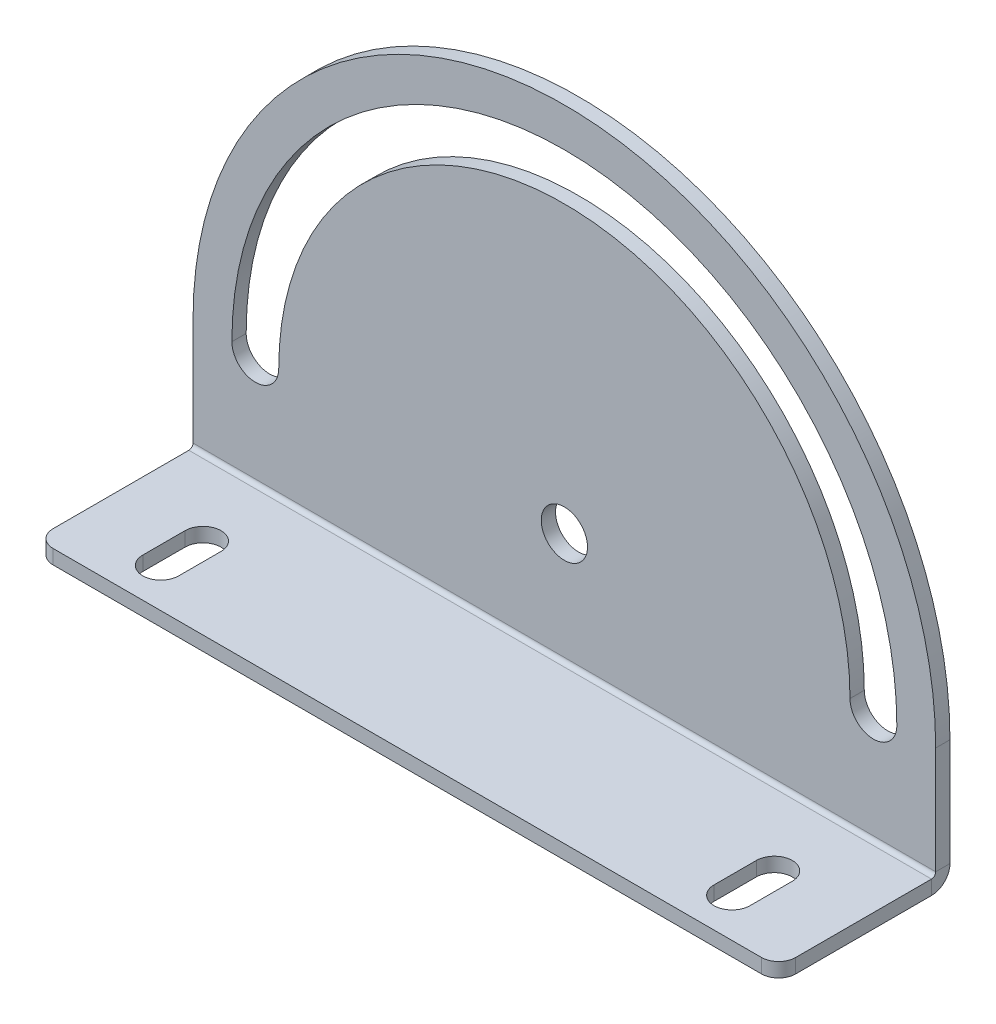
ISO-10303-21;
HEADER;
FILE_DESCRIPTION(('STEP AP214'),'2;1');
FILE_NAME('part.step','',(''),(''),'','','');
FILE_SCHEMA(('AUTOMOTIVE_DESIGN { 1 0 10303 214 1 1 1 1 }'));
ENDSEC;
DATA;
#1=APPLICATION_CONTEXT('core data for automotive mechanical design processes');
#2=APPLICATION_PROTOCOL_DEFINITION('international standard','automotive_design',2000,#1);
#3=PRODUCT_CONTEXT('',#1,'mechanical');
#4=PRODUCT('Part','Part','',(#3));
#5=PRODUCT_RELATED_PRODUCT_CATEGORY('part','',(#4));
#6=PRODUCT_DEFINITION_FORMATION('','',#4);
#7=PRODUCT_DEFINITION_CONTEXT('part definition',#1,'design');
#8=PRODUCT_DEFINITION('design','',#6,#7);
#9=PRODUCT_DEFINITION_SHAPE('','',#8);
#10=(LENGTH_UNIT() NAMED_UNIT(*) SI_UNIT(.MILLI.,.METRE.));
#11=(NAMED_UNIT(*) PLANE_ANGLE_UNIT() SI_UNIT($,.RADIAN.));
#12=(NAMED_UNIT(*) SI_UNIT($,.STERADIAN.) SOLID_ANGLE_UNIT());
#13=UNCERTAINTY_MEASURE_WITH_UNIT(LENGTH_MEASURE(1.E-05),#10,'distance_accuracy_value','');
#14=(GEOMETRIC_REPRESENTATION_CONTEXT(3) GLOBAL_UNCERTAINTY_ASSIGNED_CONTEXT((#13)) GLOBAL_UNIT_ASSIGNED_CONTEXT((#10,
#11,#12)) REPRESENTATION_CONTEXT('',''));
#15=CARTESIAN_POINT('',(0.,0.,0.));
#16=DIRECTION('',(0.,0.,1.));
#17=DIRECTION('',(1.,0.,0.));
#18=AXIS2_PLACEMENT_3D('',#15,#16,#17);
#19=CARTESIAN_POINT('',(130.,0.,-2.5));
#20=DIRECTION('',(1.,0.,0.));
#21=DIRECTION('',(0.,1.,0.));
#22=AXIS2_PLACEMENT_3D('',#19,#20,#21);
#23=PLANE('',#22);
#24=DIRECTION('',(0.,1.,0.));
#25=VECTOR('',#24,1.);
#26=CARTESIAN_POINT('',(130.,0.,0.));
#27=LINE('',#26,#25);
#28=CARTESIAN_POINT('',(130.,3.2366,0.));
#29=VERTEX_POINT('',#28);
#30=CARTESIAN_POINT('',(130.,22.,0.));
#31=VERTEX_POINT('',#30);
#32=EDGE_CURVE('E378',#29,#31,#27,.T.);
#33=ORIENTED_EDGE('',*,*,#32,.F.);
#34=DIRECTION('',(0.,0.,-1.));
#35=VECTOR('',#34,1.);
#36=CARTESIAN_POINT('',(130.,3.2366,0.));
#37=LINE('',#36,#35);
#38=CARTESIAN_POINT('',(130.,3.2366,-2.5));
#39=VERTEX_POINT('',#38);
#40=EDGE_CURVE('E312',#29,#39,#37,.T.);
#41=ORIENTED_EDGE('',*,*,#40,.T.);
#42=DIRECTION('',(0.,1.,0.));
#43=VECTOR('',#42,1.);
#44=CARTESIAN_POINT('',(130.,0.,-2.5));
#45=LINE('',#44,#43);
#46=CARTESIAN_POINT('',(130.,22.,-2.5));
#47=VERTEX_POINT('',#46);
#48=EDGE_CURVE('E369',#39,#47,#45,.T.);
#49=ORIENTED_EDGE('',*,*,#48,.T.);
#50=DIRECTION('',(0.,0.,1.));
#51=VECTOR('',#50,1.);
#52=CARTESIAN_POINT('',(130.,22.,-2.5));
#53=LINE('',#52,#51);
#54=EDGE_CURVE('E375',#47,#31,#53,.T.);
#55=ORIENTED_EDGE('',*,*,#54,.T.);
#56=EDGE_LOOP('',(#33,#41,#49,#55));
#57=FACE_BOUND('',#56,.T.);
#58=ADVANCED_FACE('F58',(#57),#23,.T.);
#59=CARTESIAN_POINT('',(65.,22.,-2.5));
#60=DIRECTION('',(0.,0.,-1.));
#61=DIRECTION('',(-1.,0.,0.));
#62=AXIS2_PLACEMENT_3D('',#59,#60,#61);
#63=PLANE('',#62);
#64=CARTESIAN_POINT('',(119.1,22.,-2.5));
#65=DIRECTION('',(0.,0.,1.));
#66=DIRECTION('',(1.,0.,0.));
#67=AXIS2_PLACEMENT_3D('',#64,#65,#66);
#68=CIRCLE('',#67,4.1);
#69=CARTESIAN_POINT('',(115.,22.,-2.5));
#70=VERTEX_POINT('',#69);
#71=CARTESIAN_POINT('',(123.2,22.,-2.5));
#72=VERTEX_POINT('',#71);
#73=EDGE_CURVE('E328',#70,#72,#68,.T.);
#74=ORIENTED_EDGE('',*,*,#73,.T.);
#75=CARTESIAN_POINT('',(65.,22.,-2.5));
#76=DIRECTION('',(0.,0.,1.));
#77=DIRECTION('',(1.,0.,0.));
#78=AXIS2_PLACEMENT_3D('',#75,#76,#77);
#79=CIRCLE('',#78,58.2);
#80=CARTESIAN_POINT('',(6.8,22.,-2.5));
#81=VERTEX_POINT('',#80);
#82=EDGE_CURVE('E331',#72,#81,#79,.T.);
#83=ORIENTED_EDGE('',*,*,#82,.T.);
#84=CARTESIAN_POINT('',(10.9,22.,-2.5));
#85=DIRECTION('',(0.,0.,1.));
#86=DIRECTION('',(1.,0.,0.));
#87=AXIS2_PLACEMENT_3D('',#84,#85,#86);
#88=CIRCLE('',#87,4.1);
#89=CARTESIAN_POINT('',(15.,22.,-2.5));
#90=VERTEX_POINT('',#89);
#91=EDGE_CURVE('E335',#81,#90,#88,.T.);
#92=ORIENTED_EDGE('',*,*,#91,.T.);
#93=CARTESIAN_POINT('',(65.,22.,-2.5));
#94=DIRECTION('',(0.,0.,-1.));
#95=DIRECTION('',(1.,0.,0.));
#96=AXIS2_PLACEMENT_3D('',#93,#94,#95);
#97=CIRCLE('',#96,50.);
#98=EDGE_CURVE('E338',#90,#70,#97,.T.);
#99=ORIENTED_EDGE('',*,*,#98,.T.);
#100=EDGE_LOOP('',(#74,#83,#92,#99));
#101=FACE_BOUND('',#100,.T.);
#102=CARTESIAN_POINT('',(65.,22.,-2.5));
#103=DIRECTION('',(0.,0.,1.));
#104=DIRECTION('',(1.,0.,0.));
#105=AXIS2_PLACEMENT_3D('',#102,#103,#104);
#106=CIRCLE('',#105,4.05);
#107=CARTESIAN_POINT('',(69.05,22.,-2.5));
#108=VERTEX_POINT('',#107);
#109=EDGE_CURVE('E360',#108,#108,#106,.T.);
#110=ORIENTED_EDGE('',*,*,#109,.T.);
#111=EDGE_LOOP('',(#110));
#112=FACE_BOUND('',#111,.T.);
#113=ORIENTED_EDGE('',*,*,#48,.F.);
#114=DIRECTION('',(1.,0.,0.));
#115=VECTOR('',#114,1.);
#116=CARTESIAN_POINT('',(130.,3.2366,-2.5));
#117=LINE('',#116,#115);
#118=CARTESIAN_POINT('',(0.,3.23660000000001,-2.5));
#119=VERTEX_POINT('',#118);
#120=EDGE_CURVE('E305',#39,#119,#117,.F.);
#121=ORIENTED_EDGE('',*,*,#120,.T.);
#122=DIRECTION('',(0.,-1.,0.));
#123=VECTOR('',#122,1.);
#124=CARTESIAN_POINT('',(0.,0.,-2.5));
#125=LINE('',#124,#123);
#126=CARTESIAN_POINT('',(0.,22.,-2.5));
#127=VERTEX_POINT('',#126);
#128=EDGE_CURVE('E366',#127,#119,#125,.T.);
#129=ORIENTED_EDGE('',*,*,#128,.F.);
#130=CARTESIAN_POINT('',(65.,22.,-2.5));
#131=DIRECTION('',(0.,0.,1.));
#132=DIRECTION('',(-1.,0.,0.));
#133=AXIS2_PLACEMENT_3D('',#130,#131,#132);
#134=CIRCLE('',#133,65.);
#135=EDGE_CURVE('E372',#47,#127,#134,.T.);
#136=ORIENTED_EDGE('',*,*,#135,.F.);
#137=EDGE_LOOP('',(#113,#121,#129,#136));
#138=FACE_BOUND('',#137,.T.);
#139=ADVANCED_FACE('F448',(#101,#112,#138),#63,.T.);
#140=CARTESIAN_POINT('',(65.,22.,0.));
#141=DIRECTION('',(0.,0.,-1.));
#142=DIRECTION('',(-1.,0.,0.));
#143=AXIS2_PLACEMENT_3D('',#140,#141,#142);
#144=PLANE('',#143);
#145=CARTESIAN_POINT('',(65.,22.,0.));
#146=DIRECTION('',(0.,0.,1.));
#147=DIRECTION('',(1.,0.,0.));
#148=AXIS2_PLACEMENT_3D('',#145,#146,#147);
#149=CIRCLE('',#148,4.05);
#150=CARTESIAN_POINT('',(69.05,22.,0.));
#151=VERTEX_POINT('',#150);
#152=EDGE_CURVE('E353',#151,#151,#149,.T.);
#153=ORIENTED_EDGE('',*,*,#152,.F.);
#154=EDGE_LOOP('',(#153));
#155=FACE_BOUND('',#154,.T.);
#156=CARTESIAN_POINT('',(65.,22.,0.));
#157=DIRECTION('',(0.,0.,1.));
#158=DIRECTION('',(1.,0.,0.));
#159=AXIS2_PLACEMENT_3D('',#156,#157,#158);
#160=CIRCLE('',#159,58.2);
#161=CARTESIAN_POINT('',(123.2,22.,0.));
#162=VERTEX_POINT('',#161);
#163=CARTESIAN_POINT('',(6.8,22.,0.));
#164=VERTEX_POINT('',#163);
#165=EDGE_CURVE('E343',#162,#164,#160,.T.);
#166=ORIENTED_EDGE('',*,*,#165,.F.);
#167=CARTESIAN_POINT('',(119.1,22.,0.));
#168=DIRECTION('',(0.,0.,1.));
#169=DIRECTION('',(1.,0.,0.));
#170=AXIS2_PLACEMENT_3D('',#167,#168,#169);
#171=CIRCLE('',#170,4.1);
#172=CARTESIAN_POINT('',(115.,22.,0.));
#173=VERTEX_POINT('',#172);
#174=EDGE_CURVE('E325',#173,#162,#171,.T.);
#175=ORIENTED_EDGE('',*,*,#174,.F.);
#176=CARTESIAN_POINT('',(65.,22.,0.));
#177=DIRECTION('',(0.,0.,-1.));
#178=DIRECTION('',(1.,0.,0.));
#179=AXIS2_PLACEMENT_3D('',#176,#177,#178);
#180=CIRCLE('',#179,50.);
#181=CARTESIAN_POINT('',(15.,22.,0.));
#182=VERTEX_POINT('',#181);
#183=EDGE_CURVE('E332',#182,#173,#180,.T.);
#184=ORIENTED_EDGE('',*,*,#183,.F.);
#185=CARTESIAN_POINT('',(10.9,22.,0.));
#186=DIRECTION('',(0.,0.,1.));
#187=DIRECTION('',(1.,0.,0.));
#188=AXIS2_PLACEMENT_3D('',#185,#186,#187);
#189=CIRCLE('',#188,4.1);
#190=EDGE_CURVE('E346',#164,#182,#189,.T.);
#191=ORIENTED_EDGE('',*,*,#190,.F.);
#192=EDGE_LOOP('',(#166,#175,#184,#191));
#193=FACE_BOUND('',#192,.T.);
#194=DIRECTION('',(1.,0.,0.));
#195=VECTOR('',#194,1.);
#196=CARTESIAN_POINT('',(130.,3.2366,0.));
#197=LINE('',#196,#195);
#198=CARTESIAN_POINT('',(0.,3.2366,0.));
#199=VERTEX_POINT('',#198);
#200=EDGE_CURVE('E318',#29,#199,#197,.F.);
#201=ORIENTED_EDGE('',*,*,#200,.F.);
#202=ORIENTED_EDGE('',*,*,#32,.T.);
#203=CARTESIAN_POINT('',(65.,22.,0.));
#204=DIRECTION('',(0.,0.,1.));
#205=DIRECTION('',(-1.,0.,0.));
#206=AXIS2_PLACEMENT_3D('',#203,#204,#205);
#207=CIRCLE('',#206,65.);
#208=CARTESIAN_POINT('',(0.,22.,0.));
#209=VERTEX_POINT('',#208);
#210=EDGE_CURVE('E370',#31,#209,#207,.T.);
#211=ORIENTED_EDGE('',*,*,#210,.T.);
#212=DIRECTION('',(0.,-1.,0.));
#213=VECTOR('',#212,1.);
#214=CARTESIAN_POINT('',(0.,0.,0.));
#215=LINE('',#214,#213);
#216=EDGE_CURVE('E363',#209,#199,#215,.T.);
#217=ORIENTED_EDGE('',*,*,#216,.T.);
#218=EDGE_LOOP('',(#201,#202,#211,#217));
#219=FACE_BOUND('',#218,.T.);
#220=ADVANCED_FACE('F439',(#155,#193,#219),#144,.F.);
#221=CARTESIAN_POINT('',(0.,0.,-2.5));
#222=DIRECTION('',(-1.,0.,0.));
#223=DIRECTION('',(0.,0.,1.));
#224=AXIS2_PLACEMENT_3D('',#221,#222,#223);
#225=PLANE('',#224);
#226=DIRECTION('',(0.,0.,-1.));
#227=VECTOR('',#226,1.);
#228=CARTESIAN_POINT('',(0.,3.2366,0.));
#229=LINE('',#228,#227);
#230=EDGE_CURVE('E322',#199,#119,#229,.T.);
#231=ORIENTED_EDGE('',*,*,#230,.F.);
#232=ORIENTED_EDGE('',*,*,#216,.F.);
#233=DIRECTION('',(0.,0.,1.));
#234=VECTOR('',#233,1.);
#235=CARTESIAN_POINT('',(0.,22.,-2.5));
#236=LINE('',#235,#234);
#237=EDGE_CURVE('E382',#127,#209,#236,.T.);
#238=ORIENTED_EDGE('',*,*,#237,.F.);
#239=ORIENTED_EDGE('',*,*,#128,.T.);
#240=EDGE_LOOP('',(#231,#232,#238,#239));
#241=FACE_BOUND('',#240,.T.);
#242=ADVANCED_FACE('F443',(#241),#225,.T.);
#243=CARTESIAN_POINT('',(65.,22.,-2.5));
#244=DIRECTION('',(0.,0.,1.));
#245=DIRECTION('',(1.,0.,0.));
#246=AXIS2_PLACEMENT_3D('',#243,#244,#245);
#247=CYLINDRICAL_SURFACE('',#246,65.);
#248=ORIENTED_EDGE('',*,*,#210,.F.);
#249=ORIENTED_EDGE('',*,*,#54,.F.);
#250=ORIENTED_EDGE('',*,*,#135,.T.);
#251=ORIENTED_EDGE('',*,*,#237,.T.);
#252=EDGE_LOOP('',(#248,#249,#250,#251));
#253=FACE_BOUND('',#252,.T.);
#254=ADVANCED_FACE('F451',(#253),#247,.T.);
#255=CARTESIAN_POINT('',(65.,22.,-2.5));
#256=DIRECTION('',(0.,0.,1.));
#257=DIRECTION('',(1.,0.,0.));
#258=AXIS2_PLACEMENT_3D('',#255,#256,#257);
#259=CYLINDRICAL_SURFACE('',#258,4.05);
#260=ORIENTED_EDGE('',*,*,#109,.F.);
#261=EDGE_LOOP('',(#260));
#262=FACE_BOUND('',#261,.T.);
#263=ORIENTED_EDGE('',*,*,#152,.T.);
#264=EDGE_LOOP('',(#263));
#265=FACE_BOUND('',#264,.T.);
#266=ADVANCED_FACE('F505',(#262,#265),#259,.F.);
#267=CARTESIAN_POINT('',(119.1,22.,-2.5));
#268=DIRECTION('',(0.,0.,1.));
#269=DIRECTION('',(1.,0.,0.));
#270=AXIS2_PLACEMENT_3D('',#267,#268,#269);
#271=CYLINDRICAL_SURFACE('',#270,4.1);
#272=ORIENTED_EDGE('',*,*,#174,.T.);
#273=DIRECTION('',(0.,0.,1.));
#274=VECTOR('',#273,1.);
#275=CARTESIAN_POINT('',(123.2,22.,-2.5));
#276=LINE('',#275,#274);
#277=EDGE_CURVE('E341',#72,#162,#276,.T.);
#278=ORIENTED_EDGE('',*,*,#277,.F.);
#279=ORIENTED_EDGE('',*,*,#73,.F.);
#280=DIRECTION('',(0.,0.,1.));
#281=VECTOR('',#280,1.);
#282=CARTESIAN_POINT('',(115.,22.,-2.5));
#283=LINE('',#282,#281);
#284=EDGE_CURVE('E351',#70,#173,#283,.T.);
#285=ORIENTED_EDGE('',*,*,#284,.T.);
#286=EDGE_LOOP('',(#272,#278,#279,#285));
#287=FACE_BOUND('',#286,.T.);
#288=ADVANCED_FACE('F495',(#287),#271,.F.);
#289=CARTESIAN_POINT('',(65.,22.,-2.5));
#290=DIRECTION('',(0.,0.,1.));
#291=DIRECTION('',(1.,0.,0.));
#292=AXIS2_PLACEMENT_3D('',#289,#290,#291);
#293=CYLINDRICAL_SURFACE('',#292,50.);
#294=ORIENTED_EDGE('',*,*,#183,.T.);
#295=ORIENTED_EDGE('',*,*,#284,.F.);
#296=ORIENTED_EDGE('',*,*,#98,.F.);
#297=DIRECTION('',(0.,0.,1.));
#298=VECTOR('',#297,1.);
#299=CARTESIAN_POINT('',(15.,22.,-2.5));
#300=LINE('',#299,#298);
#301=EDGE_CURVE('E354',#90,#182,#300,.T.);
#302=ORIENTED_EDGE('',*,*,#301,.T.);
#303=EDGE_LOOP('',(#294,#295,#296,#302));
#304=FACE_BOUND('',#303,.T.);
#305=ADVANCED_FACE('F491',(#304),#293,.T.);
#306=CARTESIAN_POINT('',(10.9,22.,-2.5));
#307=DIRECTION('',(0.,0.,1.));
#308=DIRECTION('',(1.,0.,0.));
#309=AXIS2_PLACEMENT_3D('',#306,#307,#308);
#310=CYLINDRICAL_SURFACE('',#309,4.1);
#311=ORIENTED_EDGE('',*,*,#190,.T.);
#312=ORIENTED_EDGE('',*,*,#301,.F.);
#313=ORIENTED_EDGE('',*,*,#91,.F.);
#314=DIRECTION('',(0.,0.,1.));
#315=VECTOR('',#314,1.);
#316=CARTESIAN_POINT('',(6.8,22.,-2.5));
#317=LINE('',#316,#315);
#318=EDGE_CURVE('E356',#81,#164,#317,.T.);
#319=ORIENTED_EDGE('',*,*,#318,.T.);
#320=EDGE_LOOP('',(#311,#312,#313,#319));
#321=FACE_BOUND('',#320,.T.);
#322=ADVANCED_FACE('F494',(#321),#310,.F.);
#323=CARTESIAN_POINT('',(65.,22.,-2.5));
#324=DIRECTION('',(0.,0.,1.));
#325=DIRECTION('',(1.,0.,0.));
#326=AXIS2_PLACEMENT_3D('',#323,#324,#325);
#327=CYLINDRICAL_SURFACE('',#326,58.2);
#328=ORIENTED_EDGE('',*,*,#165,.T.);
#329=ORIENTED_EDGE('',*,*,#318,.F.);
#330=ORIENTED_EDGE('',*,*,#82,.F.);
#331=ORIENTED_EDGE('',*,*,#277,.T.);
#332=EDGE_LOOP('',(#328,#329,#330,#331));
#333=FACE_BOUND('',#332,.T.);
#334=ADVANCED_FACE('F488',(#333),#327,.F.);
#335=CARTESIAN_POINT('',(0.,3.2366,0.7366));
#336=DIRECTION('',(-1.,0.,0.));
#337=DIRECTION('',(0.,0.,1.));
#338=AXIS2_PLACEMENT_3D('',#335,#336,#337);
#339=PLANE('',#338);
#340=DIRECTION('',(0.,1.,0.));
#341=VECTOR('',#340,1.);
#342=CARTESIAN_POINT('',(0.,0.,0.736599999999989));
#343=LINE('',#342,#341);
#344=CARTESIAN_POINT('',(0.,2.5,0.736599999999997));
#345=VERTEX_POINT('',#344);
#346=CARTESIAN_POINT('',(0.,0.,0.736599999999989));
#347=VERTEX_POINT('',#346);
#348=EDGE_CURVE('E277',#345,#347,#343,.F.);
#349=ORIENTED_EDGE('',*,*,#348,.F.);
#350=CARTESIAN_POINT('',(0.,3.2366,0.7366));
#351=DIRECTION('',(1.,0.,0.));
#352=DIRECTION('',(0.,0.,-1.));
#353=AXIS2_PLACEMENT_3D('',#350,#351,#352);
#354=CIRCLE('',#353,0.7366);
#355=EDGE_CURVE('E315',#199,#345,#354,.F.);
#356=ORIENTED_EDGE('',*,*,#355,.F.);
#357=ORIENTED_EDGE('',*,*,#230,.T.);
#358=CARTESIAN_POINT('',(0.,3.2366,0.7366));
#359=DIRECTION('',(1.,0.,0.));
#360=DIRECTION('',(0.,0.,-1.));
#361=AXIS2_PLACEMENT_3D('',#358,#359,#360);
#362=CIRCLE('',#361,3.2366);
#363=EDGE_CURVE('E308',#119,#347,#362,.F.);
#364=ORIENTED_EDGE('',*,*,#363,.T.);
#365=EDGE_LOOP('',(#349,#356,#357,#364));
#366=FACE_BOUND('',#365,.T.);
#367=ADVANCED_FACE('F427',(#366),#339,.T.);
#368=CARTESIAN_POINT('',(130.,3.2366,0.7366));
#369=DIRECTION('',(-1.,0.,0.));
#370=DIRECTION('',(0.,0.,1.));
#371=AXIS2_PLACEMENT_3D('',#368,#369,#370);
#372=PLANE('',#371);
#373=CARTESIAN_POINT('',(130.,3.2366,0.7366));
#374=DIRECTION('',(1.,0.,0.));
#375=DIRECTION('',(0.,0.,-1.));
#376=AXIS2_PLACEMENT_3D('',#373,#374,#375);
#377=CIRCLE('',#376,0.7366);
#378=CARTESIAN_POINT('',(130.,2.5,0.736599999999997));
#379=VERTEX_POINT('',#378);
#380=EDGE_CURVE('E281',#379,#29,#377,.T.);
#381=ORIENTED_EDGE('',*,*,#380,.F.);
#382=DIRECTION('',(0.,1.,0.));
#383=VECTOR('',#382,1.);
#384=CARTESIAN_POINT('',(130.,2.5,0.736599999999997));
#385=LINE('',#384,#383);
#386=CARTESIAN_POINT('',(130.,0.,0.736599999999989));
#387=VERTEX_POINT('',#386);
#388=EDGE_CURVE('E298',#379,#387,#385,.F.);
#389=ORIENTED_EDGE('',*,*,#388,.T.);
#390=CARTESIAN_POINT('',(130.,3.2366,0.7366));
#391=DIRECTION('',(1.,0.,0.));
#392=DIRECTION('',(0.,0.,-1.));
#393=AXIS2_PLACEMENT_3D('',#390,#391,#392);
#394=CIRCLE('',#393,3.2366);
#395=EDGE_CURVE('E309',#387,#39,#394,.T.);
#396=ORIENTED_EDGE('',*,*,#395,.T.);
#397=ORIENTED_EDGE('',*,*,#40,.F.);
#398=EDGE_LOOP('',(#381,#389,#396,#397));
#399=FACE_BOUND('',#398,.T.);
#400=ADVANCED_FACE('F421',(#399),#372,.F.);
#401=CARTESIAN_POINT('',(130.,3.2366,0.7366));
#402=DIRECTION('',(1.,0.,0.));
#403=DIRECTION('',(0.,-1.,0.));
#404=AXIS2_PLACEMENT_3D('',#401,#402,#403);
#405=CYLINDRICAL_SURFACE('',#404,3.2366);
#406=ORIENTED_EDGE('',*,*,#120,.F.);
#407=ORIENTED_EDGE('',*,*,#395,.F.);
#408=DIRECTION('',(1.,0.,0.));
#409=VECTOR('',#408,1.);
#410=CARTESIAN_POINT('',(0.,0.,0.736599999999989));
#411=LINE('',#410,#409);
#412=EDGE_CURVE('E295',#387,#347,#411,.F.);
#413=ORIENTED_EDGE('',*,*,#412,.T.);
#414=ORIENTED_EDGE('',*,*,#363,.F.);
#415=EDGE_LOOP('',(#406,#407,#413,#414));
#416=FACE_BOUND('',#415,.T.);
#417=ADVANCED_FACE('F424',(#416),#405,.T.);
#418=CARTESIAN_POINT('',(130.,3.2366,0.7366));
#419=DIRECTION('',(1.,0.,0.));
#420=DIRECTION('',(0.,-1.,0.));
#421=AXIS2_PLACEMENT_3D('',#418,#419,#420);
#422=CYLINDRICAL_SURFACE('',#421,0.7366);
#423=ORIENTED_EDGE('',*,*,#200,.T.);
#424=ORIENTED_EDGE('',*,*,#355,.T.);
#425=DIRECTION('',(1.,0.,0.));
#426=VECTOR('',#425,1.);
#427=CARTESIAN_POINT('',(0.,2.5,0.736599999999997));
#428=LINE('',#427,#426);
#429=EDGE_CURVE('E301',#345,#379,#428,.T.);
#430=ORIENTED_EDGE('',*,*,#429,.T.);
#431=ORIENTED_EDGE('',*,*,#380,.T.);
#432=EDGE_LOOP('',(#423,#424,#430,#431));
#433=FACE_BOUND('',#432,.T.);
#434=ADVANCED_FACE('F435',(#433),#422,.F.);
#435=CARTESIAN_POINT('',(0.,0.,0.));
#436=DIRECTION('',(1.,0.,0.));
#437=DIRECTION('',(0.,0.,-1.));
#438=AXIS2_PLACEMENT_3D('',#435,#436,#437);
#439=PLANE('',#438);
#440=DIRECTION('',(0.,0.,-1.));
#441=VECTOR('',#440,1.);
#442=CARTESIAN_POINT('',(0.,0.,0.));
#443=LINE('',#442,#441);
#444=CARTESIAN_POINT('',(0.,0.,24.5));
#445=VERTEX_POINT('',#444);
#446=EDGE_CURVE('E285',#445,#347,#443,.T.);
#447=ORIENTED_EDGE('',*,*,#446,.F.);
#448=DIRECTION('',(0.,1.,0.));
#449=VECTOR('',#448,1.);
#450=CARTESIAN_POINT('',(0.,0.,24.5));
#451=LINE('',#450,#449);
#452=CARTESIAN_POINT('',(0.,2.49999999999991,24.5));
#453=VERTEX_POINT('',#452);
#454=EDGE_CURVE('E13',#445,#453,#451,.T.);
#455=ORIENTED_EDGE('',*,*,#454,.T.);
#456=DIRECTION('',(0.,0.,1.));
#457=VECTOR('',#456,1.);
#458=CARTESIAN_POINT('',(0.,2.5,0.));
#459=LINE('',#458,#457);
#460=EDGE_CURVE('E293',#453,#345,#459,.F.);
#461=ORIENTED_EDGE('',*,*,#460,.T.);
#462=ORIENTED_EDGE('',*,*,#348,.T.);
#463=EDGE_LOOP('',(#447,#455,#461,#462));
#464=FACE_BOUND('',#463,.T.);
#465=ADVANCED_FACE('F431',(#464),#439,.F.);
#466=CARTESIAN_POINT('',(130.,0.,27.5));
#467=DIRECTION('',(-1.,0.,0.));
#468=DIRECTION('',(0.,0.,1.));
#469=AXIS2_PLACEMENT_3D('',#466,#467,#468);
#470=PLANE('',#469);
#471=DIRECTION('',(0.,0.,-1.));
#472=VECTOR('',#471,1.);
#473=CARTESIAN_POINT('',(130.,2.4999999999999,27.5));
#474=LINE('',#473,#472);
#475=CARTESIAN_POINT('',(130.,2.49999999999991,24.5));
#476=VERTEX_POINT('',#475);
#477=EDGE_CURVE('E290',#379,#476,#474,.F.);
#478=ORIENTED_EDGE('',*,*,#477,.T.);
#479=DIRECTION('',(0.,1.,0.));
#480=VECTOR('',#479,1.);
#481=CARTESIAN_POINT('',(130.,0.,24.5));
#482=LINE('',#481,#480);
#483=CARTESIAN_POINT('',(130.,0.,24.5));
#484=VERTEX_POINT('',#483);
#485=EDGE_CURVE('E395',#476,#484,#482,.F.);
#486=ORIENTED_EDGE('',*,*,#485,.T.);
#487=DIRECTION('',(0.,0.,1.));
#488=VECTOR('',#487,1.);
#489=CARTESIAN_POINT('',(130.,0.,0.));
#490=LINE('',#489,#488);
#491=EDGE_CURVE('E282',#387,#484,#490,.T.);
#492=ORIENTED_EDGE('',*,*,#491,.F.);
#493=ORIENTED_EDGE('',*,*,#388,.F.);
#494=EDGE_LOOP('',(#478,#486,#492,#493));
#495=FACE_BOUND('',#494,.T.);
#496=ADVANCED_FACE('F418',(#495),#470,.F.);
#497=CARTESIAN_POINT('',(0.,0.,0.));
#498=DIRECTION('',(0.,1.,0.));
#499=DIRECTION('',(0.,0.,1.));
#500=AXIS2_PLACEMENT_3D('',#497,#498,#499);
#501=PLANE('',#500);
#502=DIRECTION('',(0.,0.,-1.));
#503=VECTOR('',#502,1.);
#504=CARTESIAN_POINT('',(18.15,0.,0.));
#505=LINE('',#504,#503);
#506=CARTESIAN_POINT('',(18.15,0.,20.65));
#507=VERTEX_POINT('',#506);
#508=CARTESIAN_POINT('',(18.15,0.,13.25));
#509=VERTEX_POINT('',#508);
#510=EDGE_CURVE('E271',#507,#509,#505,.T.);
#511=ORIENTED_EDGE('',*,*,#510,.T.);
#512=CARTESIAN_POINT('',(15.,0.,13.25));
#513=DIRECTION('',(0.,1.,0.));
#514=DIRECTION('',(0.,0.,1.));
#515=AXIS2_PLACEMENT_3D('',#512,#513,#514);
#516=CIRCLE('',#515,3.15);
#517=CARTESIAN_POINT('',(11.85,0.,13.25));
#518=VERTEX_POINT('',#517);
#519=EDGE_CURVE('E274',#509,#518,#516,.T.);
#520=ORIENTED_EDGE('',*,*,#519,.T.);
#521=DIRECTION('',(0.,0.,1.));
#522=VECTOR('',#521,1.);
#523=CARTESIAN_POINT('',(11.85,0.,0.));
#524=LINE('',#523,#522);
#525=CARTESIAN_POINT('',(11.85,0.,20.65));
#526=VERTEX_POINT('',#525);
#527=EDGE_CURVE('E268',#518,#526,#524,.T.);
#528=ORIENTED_EDGE('',*,*,#527,.T.);
#529=CARTESIAN_POINT('',(15.,0.,20.65));
#530=DIRECTION('',(0.,1.,0.));
#531=DIRECTION('',(0.,0.,1.));
#532=AXIS2_PLACEMENT_3D('',#529,#530,#531);
#533=CIRCLE('',#532,3.15);
#534=EDGE_CURVE('E212',#526,#507,#533,.T.);
#535=ORIENTED_EDGE('',*,*,#534,.T.);
#536=EDGE_LOOP('',(#511,#520,#528,#535));
#537=FACE_BOUND('',#536,.T.);
#538=DIRECTION('',(0.,0.,-1.));
#539=VECTOR('',#538,1.);
#540=CARTESIAN_POINT('',(118.15,0.,0.));
#541=LINE('',#540,#539);
#542=CARTESIAN_POINT('',(118.15,0.,20.65));
#543=VERTEX_POINT('',#542);
#544=CARTESIAN_POINT('',(118.15,0.,13.25));
#545=VERTEX_POINT('',#544);
#546=EDGE_CURVE('E262',#543,#545,#541,.T.);
#547=ORIENTED_EDGE('',*,*,#546,.T.);
#548=CARTESIAN_POINT('',(115.,0.,13.25));
#549=DIRECTION('',(0.,1.,0.));
#550=DIRECTION('',(0.,0.,1.));
#551=AXIS2_PLACEMENT_3D('',#548,#549,#550);
#552=CIRCLE('',#551,3.15);
#553=CARTESIAN_POINT('',(111.85,0.,13.25));
#554=VERTEX_POINT('',#553);
#555=EDGE_CURVE('E265',#545,#554,#552,.T.);
#556=ORIENTED_EDGE('',*,*,#555,.T.);
#557=DIRECTION('',(0.,0.,1.));
#558=VECTOR('',#557,1.);
#559=CARTESIAN_POINT('',(111.85,0.,0.));
#560=LINE('',#559,#558);
#561=CARTESIAN_POINT('',(111.85,0.,20.65));
#562=VERTEX_POINT('',#561);
#563=EDGE_CURVE('E236',#554,#562,#560,.T.);
#564=ORIENTED_EDGE('',*,*,#563,.T.);
#565=CARTESIAN_POINT('',(115.,0.,20.65));
#566=DIRECTION('',(0.,1.,0.));
#567=DIRECTION('',(0.,0.,1.));
#568=AXIS2_PLACEMENT_3D('',#565,#566,#567);
#569=CIRCLE('',#568,3.15);
#570=EDGE_CURVE('E259',#562,#543,#569,.T.);
#571=ORIENTED_EDGE('',*,*,#570,.T.);
#572=EDGE_LOOP('',(#547,#556,#564,#571));
#573=FACE_BOUND('',#572,.T.);
#574=ORIENTED_EDGE('',*,*,#491,.T.);
#575=CARTESIAN_POINT('',(127.,0.,24.5));
#576=DIRECTION('',(0.,1.,0.));
#577=DIRECTION('',(0.,0.,1.));
#578=AXIS2_PLACEMENT_3D('',#575,#576,#577);
#579=CIRCLE('',#578,3.);
#580=CARTESIAN_POINT('',(127.,0.,27.5));
#581=VERTEX_POINT('',#580);
#582=EDGE_CURVE('E66',#484,#581,#579,.F.);
#583=ORIENTED_EDGE('',*,*,#582,.T.);
#584=DIRECTION('',(-1.,0.,0.));
#585=VECTOR('',#584,1.);
#586=CARTESIAN_POINT('',(0.,0.,27.5));
#587=LINE('',#586,#585);
#588=CARTESIAN_POINT('',(3.,0.,27.5));
#589=VERTEX_POINT('',#588);
#590=EDGE_CURVE('E278',#581,#589,#587,.T.);
#591=ORIENTED_EDGE('',*,*,#590,.T.);
#592=CARTESIAN_POINT('',(3.,0.,24.5));
#593=DIRECTION('',(0.,1.,0.));
#594=DIRECTION('',(0.,0.,1.));
#595=AXIS2_PLACEMENT_3D('',#592,#593,#594);
#596=CIRCLE('',#595,3.);
#597=EDGE_CURVE('E397',#589,#445,#596,.F.);
#598=ORIENTED_EDGE('',*,*,#597,.T.);
#599=ORIENTED_EDGE('',*,*,#446,.T.);
#600=ORIENTED_EDGE('',*,*,#412,.F.);
#601=EDGE_LOOP('',(#574,#583,#591,#598,#599,#600));
#602=FACE_BOUND('',#601,.T.);
#603=ADVANCED_FACE('F401',(#537,#573,#602),#501,.F.);
#604=CARTESIAN_POINT('',(0.,2.5,0.));
#605=DIRECTION('',(0.,1.,0.));
#606=DIRECTION('',(0.,0.,1.));
#607=AXIS2_PLACEMENT_3D('',#604,#605,#606);
#608=PLANE('',#607);
#609=CARTESIAN_POINT('',(15.,2.49999999999995,13.25));
#610=DIRECTION('',(0.,1.,0.));
#611=DIRECTION('',(0.,0.,1.));
#612=AXIS2_PLACEMENT_3D('',#609,#610,#611);
#613=CIRCLE('',#612,3.15);
#614=CARTESIAN_POINT('',(18.15,2.49999999999995,13.25));
#615=VERTEX_POINT('',#614);
#616=CARTESIAN_POINT('',(11.85,2.49999999999995,13.25));
#617=VERTEX_POINT('',#616);
#618=EDGE_CURVE('E224',#615,#617,#613,.T.);
#619=ORIENTED_EDGE('',*,*,#618,.F.);
#620=DIRECTION('',(0.,0.,-1.));
#621=VECTOR('',#620,1.);
#622=CARTESIAN_POINT('',(18.15,2.49999999999995,13.25));
#623=LINE('',#622,#621);
#624=CARTESIAN_POINT('',(18.15,2.49999999999993,20.65));
#625=VERTEX_POINT('',#624);
#626=EDGE_CURVE('E229',#625,#615,#623,.T.);
#627=ORIENTED_EDGE('',*,*,#626,.F.);
#628=CARTESIAN_POINT('',(15.,2.49999999999993,20.65));
#629=DIRECTION('',(0.,1.,0.));
#630=DIRECTION('',(0.,0.,1.));
#631=AXIS2_PLACEMENT_3D('',#628,#629,#630);
#632=CIRCLE('',#631,3.15);
#633=CARTESIAN_POINT('',(11.85,2.49999999999993,20.65));
#634=VERTEX_POINT('',#633);
#635=EDGE_CURVE('E209',#634,#625,#632,.T.);
#636=ORIENTED_EDGE('',*,*,#635,.F.);
#637=DIRECTION('',(0.,0.,1.));
#638=VECTOR('',#637,1.);
#639=CARTESIAN_POINT('',(11.85,2.49999999999995,13.25));
#640=LINE('',#639,#638);
#641=EDGE_CURVE('E219',#617,#634,#640,.T.);
#642=ORIENTED_EDGE('',*,*,#641,.F.);
#643=EDGE_LOOP('',(#619,#627,#636,#642));
#644=FACE_BOUND('',#643,.T.);
#645=CARTESIAN_POINT('',(115.,2.49999999999995,13.25));
#646=DIRECTION('',(0.,1.,0.));
#647=DIRECTION('',(0.,0.,-1.));
#648=AXIS2_PLACEMENT_3D('',#645,#646,#647);
#649=CIRCLE('',#648,3.15);
#650=CARTESIAN_POINT('',(118.15,2.49999999999995,13.25));
#651=VERTEX_POINT('',#650);
#652=CARTESIAN_POINT('',(111.85,2.49999999999995,13.25));
#653=VERTEX_POINT('',#652);
#654=EDGE_CURVE('E239',#651,#653,#649,.T.);
#655=ORIENTED_EDGE('',*,*,#654,.F.);
#656=DIRECTION('',(0.,0.,-1.));
#657=VECTOR('',#656,1.);
#658=CARTESIAN_POINT('',(118.15,2.49999999999995,13.25));
#659=LINE('',#658,#657);
#660=CARTESIAN_POINT('',(118.15,2.49999999999993,20.65));
#661=VERTEX_POINT('',#660);
#662=EDGE_CURVE('E246',#661,#651,#659,.T.);
#663=ORIENTED_EDGE('',*,*,#662,.F.);
#664=CARTESIAN_POINT('',(115.,2.49999999999993,20.65));
#665=DIRECTION('',(0.,1.,0.));
#666=DIRECTION('',(0.,0.,-1.));
#667=AXIS2_PLACEMENT_3D('',#664,#665,#666);
#668=CIRCLE('',#667,3.15);
#669=CARTESIAN_POINT('',(111.85,2.49999999999993,20.65));
#670=VERTEX_POINT('',#669);
#671=EDGE_CURVE('E243',#670,#661,#668,.T.);
#672=ORIENTED_EDGE('',*,*,#671,.F.);
#673=DIRECTION('',(0.,0.,1.));
#674=VECTOR('',#673,1.);
#675=CARTESIAN_POINT('',(111.85,2.49999999999995,13.25));
#676=LINE('',#675,#674);
#677=EDGE_CURVE('E241',#653,#670,#676,.T.);
#678=ORIENTED_EDGE('',*,*,#677,.F.);
#679=EDGE_LOOP('',(#655,#663,#672,#678));
#680=FACE_BOUND('',#679,.T.);
#681=DIRECTION('',(1.,0.,0.));
#682=VECTOR('',#681,1.);
#683=CARTESIAN_POINT('',(0.,2.4999999999999,27.5));
#684=LINE('',#683,#682);
#685=CARTESIAN_POINT('',(127.,2.4999999999999,27.5));
#686=VERTEX_POINT('',#685);
#687=CARTESIAN_POINT('',(3.,2.4999999999999,27.5));
#688=VERTEX_POINT('',#687);
#689=EDGE_CURVE('E287',#686,#688,#684,.F.);
#690=ORIENTED_EDGE('',*,*,#689,.F.);
#691=CARTESIAN_POINT('',(127.,2.49999999999991,24.5));
#692=DIRECTION('',(0.,1.,0.));
#693=DIRECTION('',(0.,0.,1.));
#694=AXIS2_PLACEMENT_3D('',#691,#692,#693);
#695=CIRCLE('',#694,3.);
#696=EDGE_CURVE('E393',#686,#476,#695,.T.);
#697=ORIENTED_EDGE('',*,*,#696,.T.);
#698=ORIENTED_EDGE('',*,*,#477,.F.);
#699=ORIENTED_EDGE('',*,*,#429,.F.);
#700=ORIENTED_EDGE('',*,*,#460,.F.);
#701=CARTESIAN_POINT('',(3.,2.49999999999991,24.5));
#702=DIRECTION('',(0.,1.,0.));
#703=DIRECTION('',(0.,0.,1.));
#704=AXIS2_PLACEMENT_3D('',#701,#702,#703);
#705=CIRCLE('',#704,3.);
#706=EDGE_CURVE('E391',#453,#688,#705,.T.);
#707=ORIENTED_EDGE('',*,*,#706,.T.);
#708=EDGE_LOOP('',(#690,#697,#698,#699,#700,#707));
#709=FACE_BOUND('',#708,.T.);
#710=ADVANCED_FACE('F226',(#644,#680,#709),#608,.T.);
#711=CARTESIAN_POINT('',(0.,0.,27.5));
#712=DIRECTION('',(0.,0.,-1.));
#713=DIRECTION('',(0.,1.,0.));
#714=AXIS2_PLACEMENT_3D('',#711,#712,#713);
#715=PLANE('',#714);
#716=ORIENTED_EDGE('',*,*,#590,.F.);
#717=DIRECTION('',(0.,1.,0.));
#718=VECTOR('',#717,1.);
#719=CARTESIAN_POINT('',(127.,0.,27.5));
#720=LINE('',#719,#718);
#721=EDGE_CURVE('E388',#581,#686,#720,.T.);
#722=ORIENTED_EDGE('',*,*,#721,.T.);
#723=ORIENTED_EDGE('',*,*,#689,.T.);
#724=DIRECTION('',(0.,1.,0.));
#725=VECTOR('',#724,1.);
#726=CARTESIAN_POINT('',(3.,0.,27.5));
#727=LINE('',#726,#725);
#728=EDGE_CURVE('E384',#688,#589,#727,.F.);
#729=ORIENTED_EDGE('',*,*,#728,.T.);
#730=EDGE_LOOP('',(#716,#722,#723,#729));
#731=FACE_BOUND('',#730,.T.);
#732=ADVANCED_FACE('F409',(#731),#715,.F.);
#733=CARTESIAN_POINT('',(127.,0.,24.5));
#734=DIRECTION('',(0.,1.,0.));
#735=DIRECTION('',(0.,0.,1.));
#736=AXIS2_PLACEMENT_3D('',#733,#734,#735);
#737=CYLINDRICAL_SURFACE('',#736,3.);
#738=ORIENTED_EDGE('',*,*,#582,.F.);
#739=ORIENTED_EDGE('',*,*,#485,.F.);
#740=ORIENTED_EDGE('',*,*,#696,.F.);
#741=ORIENTED_EDGE('',*,*,#721,.F.);
#742=EDGE_LOOP('',(#738,#739,#740,#741));
#743=FACE_BOUND('',#742,.T.);
#744=ADVANCED_FACE('F412',(#743),#737,.T.);
#745=CARTESIAN_POINT('',(3.,0.,24.5));
#746=DIRECTION('',(0.,1.,0.));
#747=DIRECTION('',(0.,0.,1.));
#748=AXIS2_PLACEMENT_3D('',#745,#746,#747);
#749=CYLINDRICAL_SURFACE('',#748,3.);
#750=ORIENTED_EDGE('',*,*,#597,.F.);
#751=ORIENTED_EDGE('',*,*,#728,.F.);
#752=ORIENTED_EDGE('',*,*,#706,.F.);
#753=ORIENTED_EDGE('',*,*,#454,.F.);
#754=EDGE_LOOP('',(#750,#751,#752,#753));
#755=FACE_BOUND('',#754,.T.);
#756=ADVANCED_FACE('F60',(#755),#749,.T.);
#757=CARTESIAN_POINT('',(115.,-7.50000000000005,13.25));
#758=DIRECTION('',(0.,1.,0.));
#759=DIRECTION('',(0.,0.,1.));
#760=AXIS2_PLACEMENT_3D('',#757,#758,#759);
#761=CYLINDRICAL_SURFACE('',#760,3.15);
#762=DIRECTION('',(0.,1.,0.));
#763=VECTOR('',#762,1.);
#764=CARTESIAN_POINT('',(118.15,-7.50000000000005,13.25));
#765=LINE('',#764,#763);
#766=EDGE_CURVE('E250',#545,#651,#765,.T.);
#767=ORIENTED_EDGE('',*,*,#766,.T.);
#768=ORIENTED_EDGE('',*,*,#654,.T.);
#769=DIRECTION('',(0.,1.,0.));
#770=VECTOR('',#769,1.);
#771=CARTESIAN_POINT('',(111.85,-7.50000000000005,13.25));
#772=LINE('',#771,#770);
#773=EDGE_CURVE('E249',#554,#653,#772,.T.);
#774=ORIENTED_EDGE('',*,*,#773,.F.);
#775=ORIENTED_EDGE('',*,*,#555,.F.);
#776=EDGE_LOOP('',(#767,#768,#774,#775));
#777=FACE_BOUND('',#776,.T.);
#778=ADVANCED_FACE('F469',(#777),#761,.F.);
#779=CARTESIAN_POINT('',(118.15,-7.50000000000005,13.25));
#780=DIRECTION('',(1.,0.,0.));
#781=DIRECTION('',(0.,0.,-1.));
#782=AXIS2_PLACEMENT_3D('',#779,#780,#781);
#783=PLANE('',#782);
#784=DIRECTION('',(0.,1.,0.));
#785=VECTOR('',#784,1.);
#786=CARTESIAN_POINT('',(118.15,-7.50000000000007,20.65));
#787=LINE('',#786,#785);
#788=EDGE_CURVE('E252',#543,#661,#787,.T.);
#789=ORIENTED_EDGE('',*,*,#788,.T.);
#790=ORIENTED_EDGE('',*,*,#662,.T.);
#791=ORIENTED_EDGE('',*,*,#766,.F.);
#792=ORIENTED_EDGE('',*,*,#546,.F.);
#793=EDGE_LOOP('',(#789,#790,#791,#792));
#794=FACE_BOUND('',#793,.T.);
#795=ADVANCED_FACE('F603',(#794),#783,.F.);
#796=CARTESIAN_POINT('',(115.,-7.50000000000007,20.65));
#797=DIRECTION('',(0.,1.,0.));
#798=DIRECTION('',(0.,0.,1.));
#799=AXIS2_PLACEMENT_3D('',#796,#797,#798);
#800=CYLINDRICAL_SURFACE('',#799,3.15);
#801=DIRECTION('',(0.,1.,0.));
#802=VECTOR('',#801,1.);
#803=CARTESIAN_POINT('',(111.85,-7.50000000000007,20.65));
#804=LINE('',#803,#802);
#805=EDGE_CURVE('E81',#562,#670,#804,.T.);
#806=ORIENTED_EDGE('',*,*,#805,.T.);
#807=ORIENTED_EDGE('',*,*,#671,.T.);
#808=ORIENTED_EDGE('',*,*,#788,.F.);
#809=ORIENTED_EDGE('',*,*,#570,.F.);
#810=EDGE_LOOP('',(#806,#807,#808,#809));
#811=FACE_BOUND('',#810,.T.);
#812=ADVANCED_FACE('F615',(#811),#800,.F.);
#813=CARTESIAN_POINT('',(111.85,-7.50000000000005,13.25));
#814=DIRECTION('',(-1.,0.,0.));
#815=DIRECTION('',(0.,0.,1.));
#816=AXIS2_PLACEMENT_3D('',#813,#814,#815);
#817=PLANE('',#816);
#818=ORIENTED_EDGE('',*,*,#773,.T.);
#819=ORIENTED_EDGE('',*,*,#677,.T.);
#820=ORIENTED_EDGE('',*,*,#805,.F.);
#821=ORIENTED_EDGE('',*,*,#563,.F.);
#822=EDGE_LOOP('',(#818,#819,#820,#821));
#823=FACE_BOUND('',#822,.T.);
#824=ADVANCED_FACE('F626',(#823),#817,.F.);
#825=CARTESIAN_POINT('',(15.,-7.50000000000005,13.25));
#826=DIRECTION('',(0.,1.,0.));
#827=DIRECTION('',(0.,0.,1.));
#828=AXIS2_PLACEMENT_3D('',#825,#826,#827);
#829=CYLINDRICAL_SURFACE('',#828,3.15);
#830=DIRECTION('',(0.,1.,0.));
#831=VECTOR('',#830,1.);
#832=CARTESIAN_POINT('',(18.15,-7.50000000000005,13.25));
#833=LINE('',#832,#831);
#834=EDGE_CURVE('E234',#509,#615,#833,.T.);
#835=ORIENTED_EDGE('',*,*,#834,.T.);
#836=ORIENTED_EDGE('',*,*,#618,.T.);
#837=DIRECTION('',(0.,1.,0.));
#838=VECTOR('',#837,1.);
#839=CARTESIAN_POINT('',(11.85,-7.50000000000005,13.25));
#840=LINE('',#839,#838);
#841=EDGE_CURVE('E215',#518,#617,#840,.T.);
#842=ORIENTED_EDGE('',*,*,#841,.F.);
#843=ORIENTED_EDGE('',*,*,#519,.F.);
#844=EDGE_LOOP('',(#835,#836,#842,#843));
#845=FACE_BOUND('',#844,.T.);
#846=ADVANCED_FACE('F637',(#845),#829,.F.);
#847=CARTESIAN_POINT('',(18.15,-7.50000000000005,13.25));
#848=DIRECTION('',(1.,0.,0.));
#849=DIRECTION('',(0.,0.,-1.));
#850=AXIS2_PLACEMENT_3D('',#847,#848,#849);
#851=PLANE('',#850);
#852=DIRECTION('',(0.,1.,0.));
#853=VECTOR('',#852,1.);
#854=CARTESIAN_POINT('',(18.15,-7.50000000000007,20.65));
#855=LINE('',#854,#853);
#856=EDGE_CURVE('E214',#507,#625,#855,.T.);
#857=ORIENTED_EDGE('',*,*,#856,.T.);
#858=ORIENTED_EDGE('',*,*,#626,.T.);
#859=ORIENTED_EDGE('',*,*,#834,.F.);
#860=ORIENTED_EDGE('',*,*,#510,.F.);
#861=EDGE_LOOP('',(#857,#858,#859,#860));
#862=FACE_BOUND('',#861,.T.);
#863=ADVANCED_FACE('F647',(#862),#851,.F.);
#864=CARTESIAN_POINT('',(15.,-7.50000000000007,20.65));
#865=DIRECTION('',(0.,1.,0.));
#866=DIRECTION('',(0.,0.,1.));
#867=AXIS2_PLACEMENT_3D('',#864,#865,#866);
#868=CYLINDRICAL_SURFACE('',#867,3.15);
#869=DIRECTION('',(0.,1.,0.));
#870=VECTOR('',#869,1.);
#871=CARTESIAN_POINT('',(11.85,-7.50000000000007,20.65));
#872=LINE('',#871,#870);
#873=EDGE_CURVE('E73',#526,#634,#872,.T.);
#874=ORIENTED_EDGE('',*,*,#873,.T.);
#875=ORIENTED_EDGE('',*,*,#635,.T.);
#876=ORIENTED_EDGE('',*,*,#856,.F.);
#877=ORIENTED_EDGE('',*,*,#534,.F.);
#878=EDGE_LOOP('',(#874,#875,#876,#877));
#879=FACE_BOUND('',#878,.T.);
#880=ADVANCED_FACE('F206',(#879),#868,.F.);
#881=CARTESIAN_POINT('',(11.85,-7.50000000000005,13.25));
#882=DIRECTION('',(-1.,0.,0.));
#883=DIRECTION('',(0.,0.,1.));
#884=AXIS2_PLACEMENT_3D('',#881,#882,#883);
#885=PLANE('',#884);
#886=ORIENTED_EDGE('',*,*,#841,.T.);
#887=ORIENTED_EDGE('',*,*,#641,.T.);
#888=ORIENTED_EDGE('',*,*,#873,.F.);
#889=ORIENTED_EDGE('',*,*,#527,.F.);
#890=EDGE_LOOP('',(#886,#887,#888,#889));
#891=FACE_BOUND('',#890,.T.);
#892=ADVANCED_FACE('F220',(#891),#885,.F.);
#893=CLOSED_SHELL('',(#58,#139,#220,#242,#254,#266,#288,#305,#322,#334,#367,#400,#417,#434,#465,
#496,#603,#710,#732,#744,#756,#778,#795,#812,#824,#846,#863,#880,#892));
#894=MANIFOLD_SOLID_BREP('B2',#893);
#895=ADVANCED_BREP_SHAPE_REPRESENTATION('',(#18,#894),#14);
#896=SHAPE_DEFINITION_REPRESENTATION(#9,#895);
ENDSEC;
END-ISO-10303-21;
